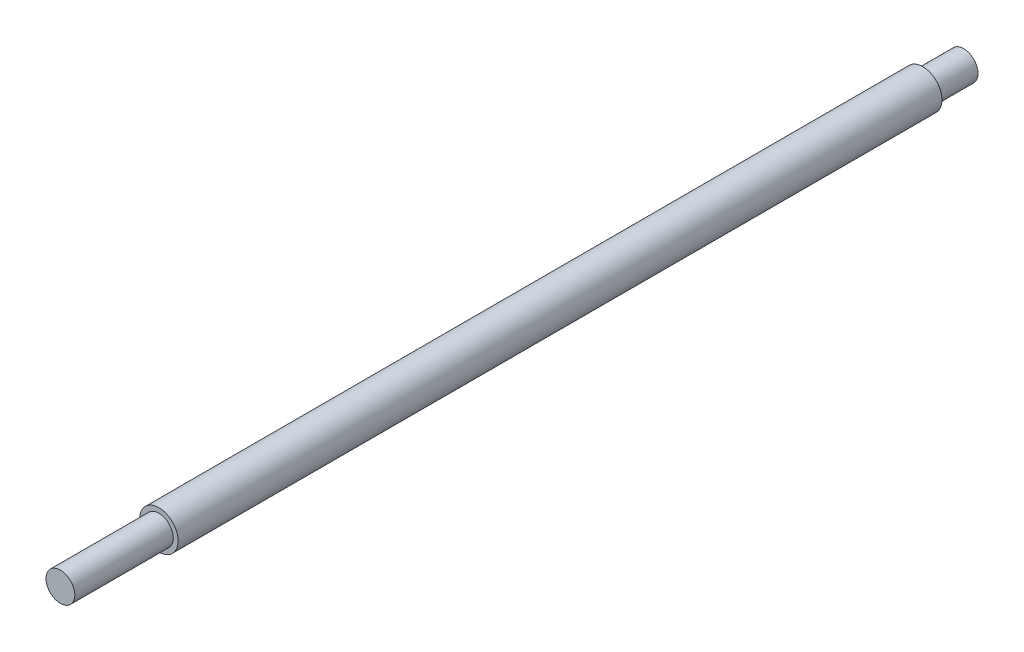
ISO-10303-21;
HEADER;
FILE_DESCRIPTION(('STEP AP214'),'2;1');
FILE_NAME('part.step','',(''),(''),'','','');
FILE_SCHEMA(('AUTOMOTIVE_DESIGN { 1 0 10303 214 1 1 1 1 }'));
ENDSEC;
DATA;
#1=APPLICATION_CONTEXT('core data for automotive mechanical design processes');
#2=APPLICATION_PROTOCOL_DEFINITION('international standard','automotive_design',2000,#1);
#3=PRODUCT_CONTEXT('',#1,'mechanical');
#4=PRODUCT('Part','Part','',(#3));
#5=PRODUCT_RELATED_PRODUCT_CATEGORY('part','',(#4));
#6=PRODUCT_DEFINITION_FORMATION('','',#4);
#7=PRODUCT_DEFINITION_CONTEXT('part definition',#1,'design');
#8=PRODUCT_DEFINITION('design','',#6,#7);
#9=PRODUCT_DEFINITION_SHAPE('','',#8);
#10=(LENGTH_UNIT() NAMED_UNIT(*) SI_UNIT(.MILLI.,.METRE.));
#11=(NAMED_UNIT(*) PLANE_ANGLE_UNIT() SI_UNIT($,.RADIAN.));
#12=(NAMED_UNIT(*) SI_UNIT($,.STERADIAN.) SOLID_ANGLE_UNIT());
#13=UNCERTAINTY_MEASURE_WITH_UNIT(LENGTH_MEASURE(1.E-05),#10,'distance_accuracy_value','');
#14=(GEOMETRIC_REPRESENTATION_CONTEXT(3) GLOBAL_UNCERTAINTY_ASSIGNED_CONTEXT((#13)) GLOBAL_UNIT_ASSIGNED_CONTEXT((#10,
#11,#12)) REPRESENTATION_CONTEXT('',''));
#15=CARTESIAN_POINT('',(0.,0.,0.));
#16=DIRECTION('',(0.,0.,1.));
#17=DIRECTION('',(1.,0.,0.));
#18=AXIS2_PLACEMENT_3D('',#15,#16,#17);
#19=CARTESIAN_POINT('',(0.,0.,366.));
#20=DIRECTION('',(0.,0.,-1.));
#21=DIRECTION('',(-1.,0.,0.));
#22=AXIS2_PLACEMENT_3D('',#19,#20,#21);
#23=CYLINDRICAL_SURFACE('',#22,8.);
#24=CARTESIAN_POINT('',(0.,0.,335.));
#25=DIRECTION('',(0.,0.,1.));
#26=DIRECTION('',(1.,0.,0.));
#27=AXIS2_PLACEMENT_3D('',#24,#25,#26);
#28=CIRCLE('',#27,8.);
#29=CARTESIAN_POINT('',(8.,0.,335.));
#30=VERTEX_POINT('',#29);
#31=EDGE_CURVE('E46',#30,#30,#28,.T.);
#32=ORIENTED_EDGE('',*,*,#31,.F.);
#33=EDGE_LOOP('',(#32));
#34=FACE_BOUND('',#33,.T.);
#35=CARTESIAN_POINT('',(0.,0.,17.));
#36=DIRECTION('',(0.,0.,-1.));
#37=DIRECTION('',(-1.,0.,0.));
#38=AXIS2_PLACEMENT_3D('',#35,#36,#37);
#39=CIRCLE('',#38,8.);
#40=CARTESIAN_POINT('',(-8.,0.,17.));
#41=VERTEX_POINT('',#40);
#42=EDGE_CURVE('E49',#41,#41,#39,.T.);
#43=ORIENTED_EDGE('',*,*,#42,.F.);
#44=EDGE_LOOP('',(#43));
#45=FACE_BOUND('',#44,.T.);
#46=ADVANCED_FACE('F27',(#34,#45),#23,.T.);
#47=CARTESIAN_POINT('',(0.,0.,335.));
#48=DIRECTION('',(0.,0.,1.));
#49=DIRECTION('',(1.,0.,0.));
#50=AXIS2_PLACEMENT_3D('',#47,#48,#49);
#51=PLANE('',#50);
#52=ORIENTED_EDGE('',*,*,#31,.T.);
#53=EDGE_LOOP('',(#52));
#54=FACE_BOUND('',#53,.T.);
#55=CARTESIAN_POINT('',(0.,0.,335.));
#56=DIRECTION('',(0.,0.,1.));
#57=DIRECTION('',(1.,0.,0.));
#58=AXIS2_PLACEMENT_3D('',#55,#56,#57);
#59=CIRCLE('',#58,6.);
#60=CARTESIAN_POINT('',(6.,0.,335.));
#61=VERTEX_POINT('',#60);
#62=EDGE_CURVE('E33',#61,#61,#59,.F.);
#63=ORIENTED_EDGE('',*,*,#62,.T.);
#64=EDGE_LOOP('',(#63));
#65=FACE_BOUND('',#64,.T.);
#66=ADVANCED_FACE('F56',(#54,#65),#51,.T.);
#67=CARTESIAN_POINT('',(0.,0.,376.));
#68=DIRECTION('',(0.,0.,1.));
#69=DIRECTION('',(1.,0.,0.));
#70=AXIS2_PLACEMENT_3D('',#67,#68,#69);
#71=PLANE('',#70);
#72=CARTESIAN_POINT('',(0.,0.,376.));
#73=DIRECTION('',(0.,0.,1.));
#74=DIRECTION('',(1.,0.,0.));
#75=AXIS2_PLACEMENT_3D('',#72,#73,#74);
#76=CIRCLE('',#75,6.);
#77=CARTESIAN_POINT('',(6.,0.,376.));
#78=VERTEX_POINT('',#77);
#79=EDGE_CURVE('E41',#78,#78,#76,.T.);
#80=ORIENTED_EDGE('',*,*,#79,.T.);
#81=EDGE_LOOP('',(#80));
#82=FACE_BOUND('',#81,.T.);
#83=ADVANCED_FACE('F63',(#82),#71,.T.);
#84=CARTESIAN_POINT('',(0.,0.,332.));
#85=DIRECTION('',(0.,0.,1.));
#86=DIRECTION('',(1.,0.,0.));
#87=AXIS2_PLACEMENT_3D('',#84,#85,#86);
#88=CYLINDRICAL_SURFACE('',#87,6.);
#89=ORIENTED_EDGE('',*,*,#62,.F.);
#90=EDGE_LOOP('',(#89));
#91=FACE_BOUND('',#90,.T.);
#92=ORIENTED_EDGE('',*,*,#79,.F.);
#93=EDGE_LOOP('',(#92));
#94=FACE_BOUND('',#93,.T.);
#95=ADVANCED_FACE('F70',(#91,#94),#88,.T.);
#96=CARTESIAN_POINT('',(0.,0.,17.));
#97=DIRECTION('',(0.,0.,-1.));
#98=DIRECTION('',(-1.,0.,0.));
#99=AXIS2_PLACEMENT_3D('',#96,#97,#98);
#100=PLANE('',#99);
#101=ORIENTED_EDGE('',*,*,#42,.T.);
#102=EDGE_LOOP('',(#101));
#103=FACE_BOUND('',#102,.T.);
#104=CARTESIAN_POINT('',(0.,0.,17.));
#105=DIRECTION('',(0.,0.,-1.));
#106=DIRECTION('',(-1.,0.,0.));
#107=AXIS2_PLACEMENT_3D('',#104,#105,#106);
#108=CIRCLE('',#107,6.);
#109=CARTESIAN_POINT('',(-6.,0.,17.));
#110=VERTEX_POINT('',#109);
#111=EDGE_CURVE('E10',#110,#110,#108,.F.);
#112=ORIENTED_EDGE('',*,*,#111,.T.);
#113=EDGE_LOOP('',(#112));
#114=FACE_BOUND('',#113,.T.);
#115=ADVANCED_FACE('F53',(#103,#114),#100,.T.);
#116=CARTESIAN_POINT('',(0.,0.,0.));
#117=DIRECTION('',(0.,0.,1.));
#118=DIRECTION('',(1.,0.,0.));
#119=AXIS2_PLACEMENT_3D('',#116,#117,#118);
#120=PLANE('',#119);
#121=CARTESIAN_POINT('',(0.,0.,0.));
#122=DIRECTION('',(0.,0.,-1.));
#123=DIRECTION('',(-1.,0.,0.));
#124=AXIS2_PLACEMENT_3D('',#121,#122,#123);
#125=CIRCLE('',#124,6.);
#126=CARTESIAN_POINT('',(-6.,0.,0.));
#127=VERTEX_POINT('',#126);
#128=EDGE_CURVE('E37',#127,#127,#125,.T.);
#129=ORIENTED_EDGE('',*,*,#128,.T.);
#130=EDGE_LOOP('',(#129));
#131=FACE_BOUND('',#130,.T.);
#132=ADVANCED_FACE('F78',(#131),#120,.F.);
#133=CARTESIAN_POINT('',(0.,0.,20.));
#134=DIRECTION('',(0.,0.,-1.));
#135=DIRECTION('',(-1.,0.,0.));
#136=AXIS2_PLACEMENT_3D('',#133,#134,#135);
#137=CYLINDRICAL_SURFACE('',#136,6.);
#138=ORIENTED_EDGE('',*,*,#111,.F.);
#139=EDGE_LOOP('',(#138));
#140=FACE_BOUND('',#139,.T.);
#141=ORIENTED_EDGE('',*,*,#128,.F.);
#142=EDGE_LOOP('',(#141));
#143=FACE_BOUND('',#142,.T.);
#144=ADVANCED_FACE('F75',(#140,#143),#137,.T.);
#145=CLOSED_SHELL('',(#46,#66,#83,#95,#115,#132,#144));
#146=MANIFOLD_SOLID_BREP('B2',#145);
#147=ADVANCED_BREP_SHAPE_REPRESENTATION('',(#18,#146),#14);
#148=SHAPE_DEFINITION_REPRESENTATION(#9,#147);
ENDSEC;
END-ISO-10303-21;
